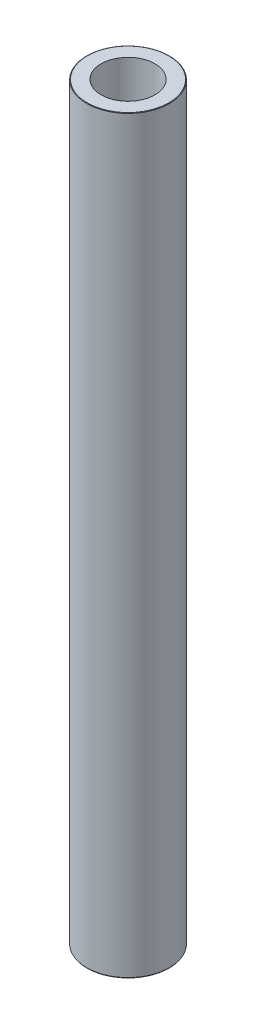
ISO-10303-21;
HEADER;
FILE_DESCRIPTION(('STEP AP214'),'2;1');
FILE_NAME('part.step','',(''),(''),'','','');
FILE_SCHEMA(('AUTOMOTIVE_DESIGN { 1 0 10303 214 1 1 1 1 }'));
ENDSEC;
DATA;
#1=APPLICATION_CONTEXT('core data for automotive mechanical design processes');
#2=APPLICATION_PROTOCOL_DEFINITION('international standard','automotive_design',2000,#1);
#3=PRODUCT_CONTEXT('',#1,'mechanical');
#4=PRODUCT('Part','Part','',(#3));
#5=PRODUCT_RELATED_PRODUCT_CATEGORY('part','',(#4));
#6=PRODUCT_DEFINITION_FORMATION('','',#4);
#7=PRODUCT_DEFINITION_CONTEXT('part definition',#1,'design');
#8=PRODUCT_DEFINITION('design','',#6,#7);
#9=PRODUCT_DEFINITION_SHAPE('','',#8);
#10=(LENGTH_UNIT() NAMED_UNIT(*) SI_UNIT(.MILLI.,.METRE.));
#11=(NAMED_UNIT(*) PLANE_ANGLE_UNIT() SI_UNIT($,.RADIAN.));
#12=(NAMED_UNIT(*) SI_UNIT($,.STERADIAN.) SOLID_ANGLE_UNIT());
#13=UNCERTAINTY_MEASURE_WITH_UNIT(LENGTH_MEASURE(1.E-05),#10,'distance_accuracy_value','');
#14=(GEOMETRIC_REPRESENTATION_CONTEXT(3) GLOBAL_UNCERTAINTY_ASSIGNED_CONTEXT((#13)) GLOBAL_UNIT_ASSIGNED_CONTEXT((#10,
#11,#12)) REPRESENTATION_CONTEXT('',''));
#15=CARTESIAN_POINT('',(0.,0.,0.));
#16=DIRECTION('',(0.,0.,1.));
#17=DIRECTION('',(1.,0.,0.));
#18=AXIS2_PLACEMENT_3D('',#15,#16,#17);
#19=CARTESIAN_POINT('',(0.,453.240774434585,0.));
#20=DIRECTION('',(0.,-1.,0.));
#21=DIRECTION('',(0.,0.,-1.));
#22=AXIS2_PLACEMENT_3D('',#19,#20,#21);
#23=CYLINDRICAL_SURFACE('',#22,25.);
#24=CARTESIAN_POINT('',(0.,453.029435638567,0.));
#25=DIRECTION('',(0.,1.,0.));
#26=DIRECTION('',(0.,0.,1.));
#27=AXIS2_PLACEMENT_3D('',#24,#25,#26);
#28=CIRCLE('',#27,25.);
#29=CARTESIAN_POINT('',(0.,453.029435638567,-25.));
#30=VERTEX_POINT('',#29);
#31=EDGE_CURVE('E50',#30,#30,#28,.F.);
#32=ORIENTED_EDGE('',*,*,#31,.T.);
#33=EDGE_LOOP('',(#32));
#34=FACE_BOUND('',#33,.T.);
#35=CARTESIAN_POINT('',(0.,0.366049532313284,0.));
#36=DIRECTION('',(0.,1.,0.));
#37=DIRECTION('',(0.,0.,1.));
#38=AXIS2_PLACEMENT_3D('',#35,#36,#37);
#39=CIRCLE('',#38,25.);
#40=CARTESIAN_POINT('',(0.,0.366049532313284,25.));
#41=VERTEX_POINT('',#40);
#42=EDGE_CURVE('E51',#41,#41,#39,.T.);
#43=ORIENTED_EDGE('',*,*,#42,.T.);
#44=EDGE_LOOP('',(#43));
#45=FACE_BOUND('',#44,.T.);
#46=ADVANCED_FACE('F39',(#34,#45),#23,.T.);
#47=CARTESIAN_POINT('',(0.,453.240774434585,0.));
#48=DIRECTION('',(0.,1.,0.));
#49=DIRECTION('',(0.,0.,1.));
#50=AXIS2_PLACEMENT_3D('',#47,#48,#49);
#51=PLANE('',#50);
#52=CARTESIAN_POINT('',(0.,453.240774434585,0.));
#53=DIRECTION('',(0.,1.,0.));
#54=DIRECTION('',(0.,0.,1.));
#55=AXIS2_PLACEMENT_3D('',#52,#53,#54);
#56=CIRCLE('',#55,24.6339504676867);
#57=CARTESIAN_POINT('',(0.,453.240774434585,-24.6339504676868));
#58=VERTEX_POINT('',#57);
#59=EDGE_CURVE('E54',#58,#58,#56,.T.);
#60=ORIENTED_EDGE('',*,*,#59,.T.);
#61=EDGE_LOOP('',(#60));
#62=FACE_BOUND('',#61,.T.);
#63=CARTESIAN_POINT('',(0.,453.240774434585,0.));
#64=DIRECTION('',(0.,1.,0.));
#65=DIRECTION('',(0.,0.,1.));
#66=AXIS2_PLACEMENT_3D('',#63,#64,#65);
#67=CIRCLE('',#66,16.2933888802648);
#68=CARTESIAN_POINT('',(0.,453.240774434585,16.2933888802648));
#69=VERTEX_POINT('',#68);
#70=EDGE_CURVE('E58',#69,#69,#67,.T.);
#71=ORIENTED_EDGE('',*,*,#70,.F.);
#72=EDGE_LOOP('',(#71));
#73=FACE_BOUND('',#72,.T.);
#74=ADVANCED_FACE('F69',(#62,#73),#51,.T.);
#75=CARTESIAN_POINT('',(0.,0.,0.));
#76=DIRECTION('',(0.,1.,0.));
#77=DIRECTION('',(0.,0.,1.));
#78=AXIS2_PLACEMENT_3D('',#75,#76,#77);
#79=PLANE('',#78);
#80=CARTESIAN_POINT('',(0.,0.,0.));
#81=DIRECTION('',(0.,1.,0.));
#82=DIRECTION('',(0.,0.,1.));
#83=AXIS2_PLACEMENT_3D('',#80,#81,#82);
#84=CIRCLE('',#83,24.7886612039822);
#85=CARTESIAN_POINT('',(0.,0.,24.7886612039822));
#86=VERTEX_POINT('',#85);
#87=EDGE_CURVE('E10',#86,#86,#84,.F.);
#88=ORIENTED_EDGE('',*,*,#87,.T.);
#89=EDGE_LOOP('',(#88));
#90=FACE_BOUND('',#89,.T.);
#91=CARTESIAN_POINT('',(0.,0.,0.));
#92=DIRECTION('',(0.,1.,0.));
#93=DIRECTION('',(0.,0.,1.));
#94=AXIS2_PLACEMENT_3D('',#91,#92,#93);
#95=CIRCLE('',#94,16.2933888802648);
#96=CARTESIAN_POINT('',(0.,0.,16.2933888802648));
#97=VERTEX_POINT('',#96);
#98=EDGE_CURVE('E63',#97,#97,#95,.T.);
#99=ORIENTED_EDGE('',*,*,#98,.T.);
#100=EDGE_LOOP('',(#99));
#101=FACE_BOUND('',#100,.T.);
#102=ADVANCED_FACE('F75',(#90,#101),#79,.F.);
#103=CARTESIAN_POINT('',(0.,453.240774434585,0.));
#104=DIRECTION('',(0.,-1.,0.));
#105=DIRECTION('',(0.,0.,-1.));
#106=AXIS2_PLACEMENT_3D('',#103,#104,#105);
#107=CYLINDRICAL_SURFACE('',#106,16.2933888802648);
#108=ORIENTED_EDGE('',*,*,#70,.T.);
#109=EDGE_LOOP('',(#108));
#110=FACE_BOUND('',#109,.T.);
#111=ORIENTED_EDGE('',*,*,#98,.F.);
#112=EDGE_LOOP('',(#111));
#113=FACE_BOUND('',#112,.T.);
#114=ADVANCED_FACE('F70',(#110,#113),#107,.F.);
#115=CARTESIAN_POINT('',(0.,453.240774434585,0.));
#116=DIRECTION('',(0.,-1.,0.));
#117=DIRECTION('',(0.,0.,-1.));
#118=AXIS2_PLACEMENT_3D('',#115,#116,#117);
#119=CONICAL_SURFACE('',#118,24.6339504676867,1.04719755119646);
#120=CARTESIAN_POINT('',(0.,453.029435638567,-25.));
#121=CARTESIAN_POINT('',(0.,453.031637084359,-24.9961869840385));
#122=CARTESIAN_POINT('',(0.,453.033838530151,-24.9923739680769));
#123=CARTESIAN_POINT('',(0.,453.038241421734,-24.9847479361537));
#124=CARTESIAN_POINT('',(0.,453.040442867526,-24.9809349201921));
#125=CARTESIAN_POINT('',(0.,453.04484575911,-24.9733088882689));
#126=CARTESIAN_POINT('',(0.,453.047047204902,-24.9694958723073));
#127=CARTESIAN_POINT('',(0.,453.051450096485,-24.9618698403841));
#128=CARTESIAN_POINT('',(0.,453.053651542277,-24.9580568244225));
#129=CARTESIAN_POINT('',(0.,453.058054433861,-24.9504307924993));
#130=CARTESIAN_POINT('',(0.,453.060255879653,-24.9466177765377));
#131=CARTESIAN_POINT('',(0.,453.064658771237,-24.9389917446145));
#132=CARTESIAN_POINT('',(0.,453.066860217028,-24.9351787286529));
#133=CARTESIAN_POINT('',(0.,453.071263108612,-24.9275526967297));
#134=CARTESIAN_POINT('',(0.,453.073464554404,-24.9237396807681));
#135=CARTESIAN_POINT('',(0.,453.077867445988,-24.9161136488449));
#136=CARTESIAN_POINT('',(0.,453.080068891779,-24.9123006328833));
#137=CARTESIAN_POINT('',(0.,453.084471783363,-24.9046746009601));
#138=CARTESIAN_POINT('',(0.,453.086673229155,-24.9008615849985));
#139=CARTESIAN_POINT('',(0.,453.091076120739,-24.8932355530754));
#140=CARTESIAN_POINT('',(0.,453.093277566531,-24.8894225371137));
#141=CARTESIAN_POINT('',(0.,453.097680458114,-24.8817965051906));
#142=CARTESIAN_POINT('',(0.,453.099881903906,-24.877983489229));
#143=CARTESIAN_POINT('',(0.,453.10428479549,-24.8703574573058));
#144=CARTESIAN_POINT('',(0.,453.106486241282,-24.8665444413442));
#145=CARTESIAN_POINT('',(0.,453.110889132865,-24.858918409421));
#146=CARTESIAN_POINT('',(0.,453.113090578657,-24.8551053934594));
#147=CARTESIAN_POINT('',(0.,453.117493470241,-24.8474793615362));
#148=CARTESIAN_POINT('',(0.,453.119694916033,-24.8436663455746));
#149=CARTESIAN_POINT('',(0.,453.124097807617,-24.8360403136514));
#150=CARTESIAN_POINT('',(0.,453.126299253408,-24.8322272976898));
#151=CARTESIAN_POINT('',(0.,453.130702144992,-24.8246012657666));
#152=CARTESIAN_POINT('',(0.,453.132903590784,-24.820788249805));
#153=CARTESIAN_POINT('',(0.,453.137306482368,-24.8131622178818));
#154=CARTESIAN_POINT('',(0.,453.13950792816,-24.8093492019202));
#155=CARTESIAN_POINT('',(0.,453.143910819743,-24.801723169997));
#156=CARTESIAN_POINT('',(0.,453.146112265535,-24.7979101540354));
#157=CARTESIAN_POINT('',(0.,453.150515157119,-24.7902841221122));
#158=CARTESIAN_POINT('',(0.,453.152716602911,-24.7864711061506));
#159=CARTESIAN_POINT('',(0.,453.157119494494,-24.7788450742275));
#160=CARTESIAN_POINT('',(0.,453.159320940286,-24.7750320582659));
#161=CARTESIAN_POINT('',(0.,453.16372383187,-24.7674060263427));
#162=CARTESIAN_POINT('',(0.,453.165925277662,-24.7635930103811));
#163=CARTESIAN_POINT('',(0.,453.170328169245,-24.7559669784579));
#164=CARTESIAN_POINT('',(0.,453.172529615037,-24.7521539624963));
#165=CARTESIAN_POINT('',(0.,453.176932506621,-24.7445279305731));
#166=CARTESIAN_POINT('',(0.,453.179133952413,-24.7407149146115));
#167=CARTESIAN_POINT('',(0.,453.183536843997,-24.7330888826883));
#168=CARTESIAN_POINT('',(0.,453.185738289788,-24.7292758667267));
#169=CARTESIAN_POINT('',(0.,453.190141181372,-24.7216498348035));
#170=CARTESIAN_POINT('',(0.,453.192342627164,-24.7178368188419));
#171=CARTESIAN_POINT('',(0.,453.196745518748,-24.7102107869187));
#172=CARTESIAN_POINT('',(0.,453.19894696454,-24.7063977709571));
#173=CARTESIAN_POINT('',(0.,453.203349856123,-24.6987717390339));
#174=CARTESIAN_POINT('',(0.,453.205551301915,-24.6949587230723));
#175=CARTESIAN_POINT('',(0.,453.209954193499,-24.6873326911491));
#176=CARTESIAN_POINT('',(0.,453.212155639291,-24.6835196751875));
#177=CARTESIAN_POINT('',(0.,453.216558530874,-24.6758936432643));
#178=CARTESIAN_POINT('',(0.,453.218759976666,-24.6720806273027));
#179=CARTESIAN_POINT('',(0.,453.22316286825,-24.6644545953796));
#180=CARTESIAN_POINT('',(0.,453.225364314042,-24.660641579418));
#181=CARTESIAN_POINT('',(0.,453.229767205625,-24.6530155474948));
#182=CARTESIAN_POINT('',(0.,453.231968651417,-24.6492025315332));
#183=CARTESIAN_POINT('',(0.,453.236371543001,-24.64157649961));
#184=CARTESIAN_POINT('',(0.,453.238572988793,-24.6377634836484));
#185=CARTESIAN_POINT('',(0.,453.240774434585,-24.6339504676868));
#186=B_SPLINE_CURVE_WITH_KNOTS('',3,(#120,#121,#122,#123,#124,#125,#126,#127,#128,#129,#130,
#131,#132,#133,#134,#135,#136,#137,#138,#139,#140,#141,#142,#143,#144,#145,#146,#147,#148,#149,
#150,#151,#152,#153,#154,#155,#156,#157,#158,#159,#160,#161,#162,#163,#164,#165,#166,#167,#168,
#169,#170,#171,#172,#173,#174,#175,#176,#177,#178,#179,#180,#181,#182,#183,#184,#185),
.UNSPECIFIED.,.F.,.F.,(4,2,2,2,2,2,2,2,2,2,2,2,2,2,2,2,2,2,2,2,2,2,2,2,2,2,2,2,2,2,2,2,4),(0.,
0.0132086747511299,0.0264173495022351,0.039626024253365,0.0528346990044672,0.0660433737555724,
0.0792520485067023,0.0924607232578045,0.10566939800891,0.11887807276004,0.132086747511142,
0.145295422262275,0.158504097013377,0.171712771764479,0.184921446515609,0.198130121266714,
0.211338796017816,0.224547470768946,0.237756145520051,0.250964820271181,0.264173495022284,
0.277382169773389,0.290590844524519,0.303799519275621,0.317008194026754,0.330216868777856,
0.343425543528958,0.356634218280091,0.369842893031193,0.383051567782295,0.396260242533428,
0.40946891728453,0.42267759203566),.UNSPECIFIED.);
#187=EDGE_CURVE('BSEAM81',#30,#58,#186,.T.);
#188=ORIENTED_EDGE('',*,*,#31,.F.);
#189=ORIENTED_EDGE('',*,*,#59,.F.);
#190=ORIENTED_EDGE('',*,*,#187,.T.);
#191=ORIENTED_EDGE('',*,*,#187,.F.);
#192=EDGE_LOOP('',(#188,#190,#189,#191));
#193=FACE_BOUND('',#192,.T.);
#194=ADVANCED_FACE('F81',(#193),#119,.T.);
#195=CARTESIAN_POINT('',(0.,0.366049532313284,0.));
#196=DIRECTION('',(0.,1.,0.));
#197=DIRECTION('',(0.,0.,1.));
#198=AXIS2_PLACEMENT_3D('',#195,#196,#197);
#199=CONICAL_SURFACE('',#198,25.,0.523598775598316);
#200=ORIENTED_EDGE('',*,*,#87,.F.);
#201=EDGE_LOOP('',(#200));
#202=FACE_BOUND('',#201,.T.);
#203=ORIENTED_EDGE('',*,*,#42,.F.);
#204=EDGE_LOOP('',(#203));
#205=FACE_BOUND('',#204,.T.);
#206=ADVANCED_FACE('F45',(#202,#205),#199,.T.);
#207=CLOSED_SHELL('',(#46,#74,#102,#114,#194,#206));
#208=MANIFOLD_SOLID_BREP('B2',#207);
#209=ADVANCED_BREP_SHAPE_REPRESENTATION('',(#18,#208),#14);
#210=SHAPE_DEFINITION_REPRESENTATION(#9,#209);
ENDSEC;
END-ISO-10303-21;
